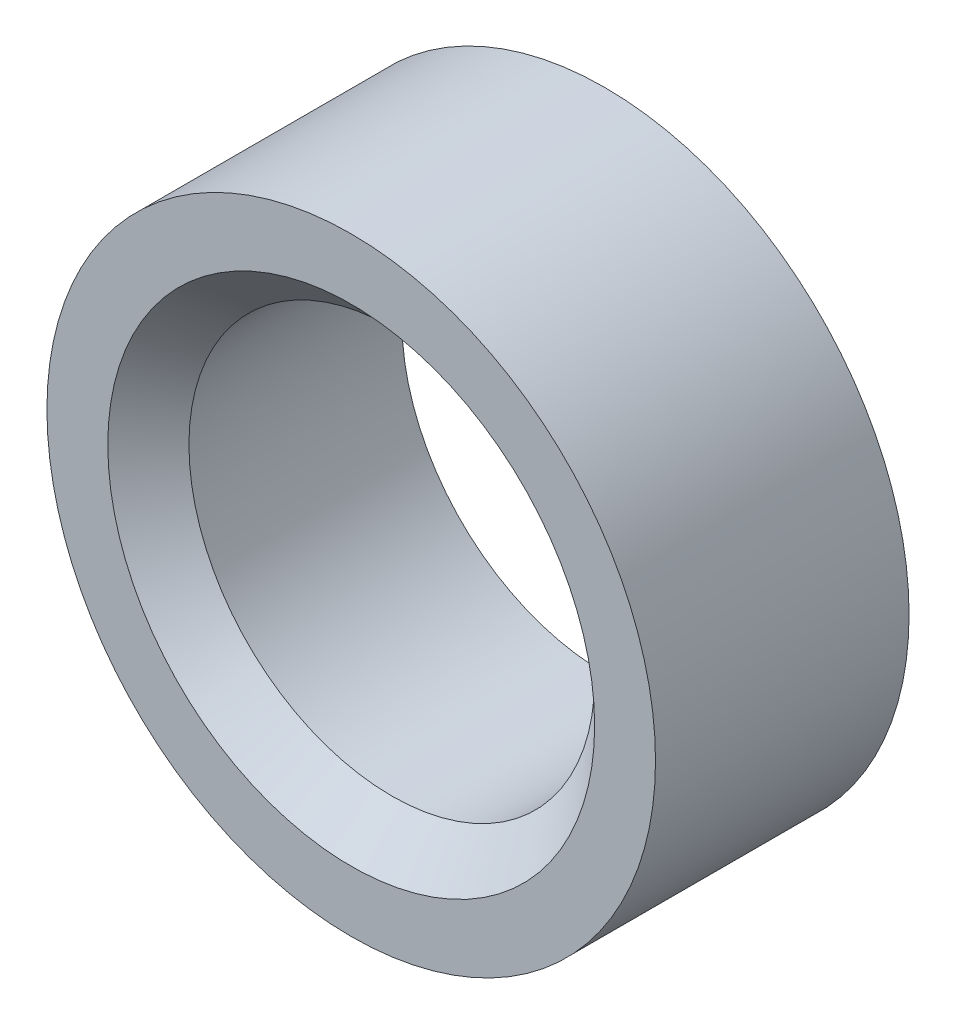
ISO-10303-21;
HEADER;
FILE_DESCRIPTION(('STEP AP214'),'2;1');
FILE_NAME('part.step','',(''),(''),'','','');
FILE_SCHEMA(('AUTOMOTIVE_DESIGN { 1 0 10303 214 1 1 1 1 }'));
ENDSEC;
DATA;
#1=APPLICATION_CONTEXT('core data for automotive mechanical design processes');
#2=APPLICATION_PROTOCOL_DEFINITION('international standard','automotive_design',2000,#1);
#3=PRODUCT_CONTEXT('',#1,'mechanical');
#4=PRODUCT('Part','Part','',(#3));
#5=PRODUCT_RELATED_PRODUCT_CATEGORY('part','',(#4));
#6=PRODUCT_DEFINITION_FORMATION('','',#4);
#7=PRODUCT_DEFINITION_CONTEXT('part definition',#1,'design');
#8=PRODUCT_DEFINITION('design','',#6,#7);
#9=PRODUCT_DEFINITION_SHAPE('','',#8);
#10=(LENGTH_UNIT() NAMED_UNIT(*) SI_UNIT(.MILLI.,.METRE.));
#11=(NAMED_UNIT(*) PLANE_ANGLE_UNIT() SI_UNIT($,.RADIAN.));
#12=(NAMED_UNIT(*) SI_UNIT($,.STERADIAN.) SOLID_ANGLE_UNIT());
#13=UNCERTAINTY_MEASURE_WITH_UNIT(LENGTH_MEASURE(1.E-05),#10,'distance_accuracy_value','');
#14=(GEOMETRIC_REPRESENTATION_CONTEXT(3) GLOBAL_UNCERTAINTY_ASSIGNED_CONTEXT((#13)) GLOBAL_UNIT_ASSIGNED_CONTEXT((#10,
#11,#12)) REPRESENTATION_CONTEXT('',''));
#15=CARTESIAN_POINT('',(0.,0.,0.));
#16=DIRECTION('',(0.,0.,1.));
#17=DIRECTION('',(1.,0.,0.));
#18=AXIS2_PLACEMENT_3D('',#15,#16,#17);
#19=CARTESIAN_POINT('',(-3.40005801291454E-13,1.27675647831893E-12,25.0000000000001));
#20=DIRECTION('',(0.,0.,0.999999999999997));
#21=DIRECTION('',(1.,0.,0.));
#22=AXIS2_PLACEMENT_3D('',#19,#20,#21);
#23=CONICAL_SURFACE('',#22,24.,0.78539816339745);
#24=CARTESIAN_POINT('',(2.08166817117217E-13,1.66533453693773E-13,21.000000000001));
#25=DIRECTION('',(0.,0.,-0.999999999999997));
#26=DIRECTION('',(-1.,0.,0.));
#27=AXIS2_PLACEMENT_3D('',#24,#25,#26);
#28=CIRCLE('',#27,20.);
#29=CARTESIAN_POINT('',(-19.9999999999998,1.53210777398272E-13,21.000000000001));
#30=VERTEX_POINT('',#29);
#31=EDGE_CURVE('E33',#30,#30,#28,.T.);
#32=ORIENTED_EDGE('',*,*,#31,.T.);
#33=EDGE_LOOP('',(#32));
#34=FACE_BOUND('',#33,.T.);
#35=CARTESIAN_POINT('',(-3.40005801291454E-13,1.27675647831893E-12,25.0000000000001));
#36=DIRECTION('',(0.,0.,0.999999999999997));
#37=DIRECTION('',(1.,0.,0.));
#38=AXIS2_PLACEMENT_3D('',#35,#36,#37);
#39=CIRCLE('',#38,24.);
#40=CARTESIAN_POINT('',(23.9999999999997,1.29274368987353E-12,25.0000000000001));
#41=VERTEX_POINT('',#40);
#42=EDGE_CURVE('E17',#41,#41,#39,.F.);
#43=ORIENTED_EDGE('',*,*,#42,.F.);
#44=EDGE_LOOP('',(#43));
#45=FACE_BOUND('',#44,.T.);
#46=ADVANCED_FACE('F14',(#34,#45),#23,.F.);
#47=CARTESIAN_POINT('',(-3.40005801291454E-13,1.27675647831893E-12,25.0000000000001));
#48=DIRECTION('',(0.,0.,-0.999999999999997));
#49=DIRECTION('',(-1.,0.,0.));
#50=AXIS2_PLACEMENT_3D('',#47,#48,#49);
#51=CYLINDRICAL_SURFACE('',#50,20.);
#52=CARTESIAN_POINT('',(0.,0.,0.));
#53=DIRECTION('',(0.,0.,-0.999999999999997));
#54=DIRECTION('',(-1.,0.,0.));
#55=AXIS2_PLACEMENT_3D('',#52,#53,#54);
#56=CIRCLE('',#55,20.);
#57=CARTESIAN_POINT('',(-20.,0.,0.));
#58=VERTEX_POINT('',#57);
#59=EDGE_CURVE('E30',#58,#58,#56,.T.);
#60=ORIENTED_EDGE('',*,*,#59,.T.);
#61=EDGE_LOOP('',(#60));
#62=FACE_BOUND('',#61,.T.);
#63=ORIENTED_EDGE('',*,*,#31,.F.);
#64=EDGE_LOOP('',(#63));
#65=FACE_BOUND('',#64,.T.);
#66=ADVANCED_FACE('F51',(#62,#65),#51,.F.);
#67=CARTESIAN_POINT('',(-3.40005801291454E-13,1.27675647831893E-12,25.0000000000001));
#68=DIRECTION('',(0.,0.,0.999999999999997));
#69=DIRECTION('',(1.,0.,0.));
#70=AXIS2_PLACEMENT_3D('',#67,#68,#69);
#71=PLANE('',#70);
#72=CARTESIAN_POINT('',(-3.40005801291454E-13,1.27675647831893E-12,25.0000000000001));
#73=DIRECTION('',(0.,0.,-0.999999999999997));
#74=DIRECTION('',(-1.,0.,0.));
#75=AXIS2_PLACEMENT_3D('',#72,#73,#74);
#76=CIRCLE('',#75,30.);
#77=CARTESIAN_POINT('',(-30.0000000000004,1.25677246387568E-12,25.0000000000001));
#78=VERTEX_POINT('',#77);
#79=EDGE_CURVE('E22',#78,#78,#76,.T.);
#80=ORIENTED_EDGE('',*,*,#79,.F.);
#81=EDGE_LOOP('',(#80));
#82=FACE_BOUND('',#81,.T.);
#83=ORIENTED_EDGE('',*,*,#42,.T.);
#84=EDGE_LOOP('',(#83));
#85=FACE_BOUND('',#84,.T.);
#86=ADVANCED_FACE('F53',(#82,#85),#71,.T.);
#87=CARTESIAN_POINT('',(0.,0.,0.));
#88=DIRECTION('',(0.,0.,0.999999999999997));
#89=DIRECTION('',(1.,0.,0.));
#90=AXIS2_PLACEMENT_3D('',#87,#88,#89);
#91=PLANE('',#90);
#92=ORIENTED_EDGE('',*,*,#59,.F.);
#93=EDGE_LOOP('',(#92));
#94=FACE_BOUND('',#93,.T.);
#95=CARTESIAN_POINT('',(0.,0.,0.));
#96=DIRECTION('',(0.,0.,-0.999999999999997));
#97=DIRECTION('',(-1.,0.,0.));
#98=AXIS2_PLACEMENT_3D('',#95,#96,#97);
#99=CIRCLE('',#98,30.);
#100=CARTESIAN_POINT('',(-30.,0.,0.));
#101=VERTEX_POINT('',#100);
#102=EDGE_CURVE('E10',#101,#101,#99,.F.);
#103=ORIENTED_EDGE('',*,*,#102,.F.);
#104=EDGE_LOOP('',(#103));
#105=FACE_BOUND('',#104,.T.);
#106=ADVANCED_FACE('F59',(#94,#105),#91,.F.);
#107=CARTESIAN_POINT('',(-3.40005801291454E-13,1.27675647831893E-12,25.0000000000001));
#108=DIRECTION('',(0.,0.,-0.999999999999997));
#109=DIRECTION('',(-1.,0.,0.));
#110=AXIS2_PLACEMENT_3D('',#107,#108,#109);
#111=CYLINDRICAL_SURFACE('',#110,30.);
#112=ORIENTED_EDGE('',*,*,#102,.T.);
#113=EDGE_LOOP('',(#112));
#114=FACE_BOUND('',#113,.T.);
#115=ORIENTED_EDGE('',*,*,#79,.T.);
#116=EDGE_LOOP('',(#115));
#117=FACE_BOUND('',#116,.T.);
#118=ADVANCED_FACE('F62',(#114,#117),#111,.T.);
#119=CLOSED_SHELL('',(#46,#66,#86,#106,#118));
#120=MANIFOLD_SOLID_BREP('B1',#119);
#121=ADVANCED_BREP_SHAPE_REPRESENTATION('',(#18,#120),#14);
#122=SHAPE_DEFINITION_REPRESENTATION(#9,#121);
ENDSEC;
END-ISO-10303-21;
